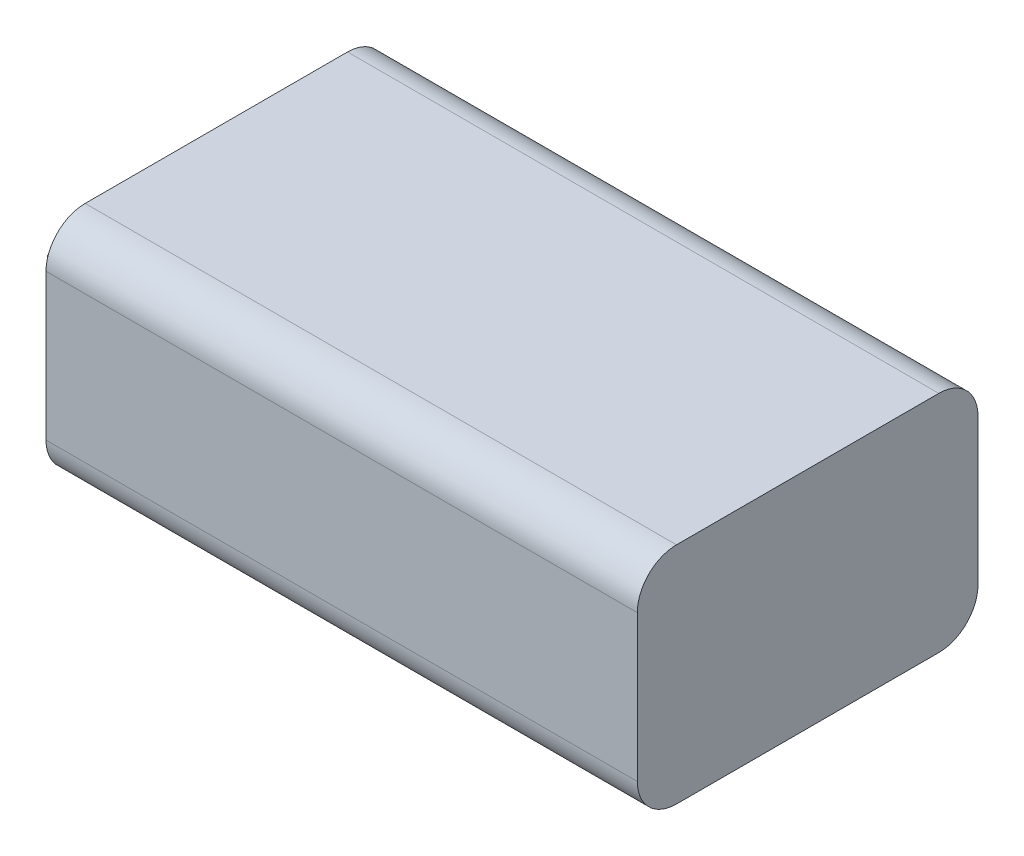
ISO-10303-21;
HEADER;
FILE_DESCRIPTION(('STEP AP214'),'2;1');
FILE_NAME('part.step','',(''),(''),'','','');
FILE_SCHEMA(('AUTOMOTIVE_DESIGN { 1 0 10303 214 1 1 1 1 }'));
ENDSEC;
DATA;
#1=APPLICATION_CONTEXT('core data for automotive mechanical design processes');
#2=APPLICATION_PROTOCOL_DEFINITION('international standard','automotive_design',2000,#1);
#3=PRODUCT_CONTEXT('',#1,'mechanical');
#4=PRODUCT('Part','Part','',(#3));
#5=PRODUCT_RELATED_PRODUCT_CATEGORY('part','',(#4));
#6=PRODUCT_DEFINITION_FORMATION('','',#4);
#7=PRODUCT_DEFINITION_CONTEXT('part definition',#1,'design');
#8=PRODUCT_DEFINITION('design','',#6,#7);
#9=PRODUCT_DEFINITION_SHAPE('','',#8);
#10=(LENGTH_UNIT() NAMED_UNIT(*) SI_UNIT(.MILLI.,.METRE.));
#11=(NAMED_UNIT(*) PLANE_ANGLE_UNIT() SI_UNIT($,.RADIAN.));
#12=(NAMED_UNIT(*) SI_UNIT($,.STERADIAN.) SOLID_ANGLE_UNIT());
#13=UNCERTAINTY_MEASURE_WITH_UNIT(LENGTH_MEASURE(1.E-05),#10,'distance_accuracy_value','');
#14=(GEOMETRIC_REPRESENTATION_CONTEXT(3) GLOBAL_UNCERTAINTY_ASSIGNED_CONTEXT((#13)) GLOBAL_UNIT_ASSIGNED_CONTEXT((#10,
#11,#12)) REPRESENTATION_CONTEXT('',''));
#15=CARTESIAN_POINT('',(0.,0.,0.));
#16=DIRECTION('',(0.,0.,1.));
#17=DIRECTION('',(1.,0.,0.));
#18=AXIS2_PLACEMENT_3D('',#15,#16,#17);
#19=CARTESIAN_POINT('',(-32.2060701312199,17.2,0.));
#20=DIRECTION('',(-1.,0.,0.));
#21=DIRECTION('',(0.,0.,1.));
#22=AXIS2_PLACEMENT_3D('',#19,#20,#21);
#23=PLANE('',#22);
#24=DIRECTION('',(0.,0.,-1.));
#25=VECTOR('',#24,1.);
#26=CARTESIAN_POINT('',(-32.2060701312199,17.2,0.));
#27=LINE('',#26,#25);
#28=CARTESIAN_POINT('',(-32.2060701312199,17.2,6.82588235294117));
#29=VERTEX_POINT('',#28);
#30=CARTESIAN_POINT('',(-32.2060701312199,17.2,-13.2741176470588));
#31=VERTEX_POINT('',#30);
#32=EDGE_CURVE('E192',#29,#31,#27,.T.);
#33=ORIENTED_EDGE('',*,*,#32,.T.);
#34=CARTESIAN_POINT('',(-32.2060701312199,14.2,-13.2741176470588));
#35=DIRECTION('',(-1.,0.,0.));
#36=DIRECTION('',(0.,0.,1.));
#37=AXIS2_PLACEMENT_3D('',#34,#35,#36);
#38=CIRCLE('',#37,3.);
#39=CARTESIAN_POINT('',(-32.2060701312199,14.2,-16.2741176470588));
#40=VERTEX_POINT('',#39);
#41=EDGE_CURVE('E252',#31,#40,#38,.T.);
#42=ORIENTED_EDGE('',*,*,#41,.T.);
#43=DIRECTION('',(0.,-1.,0.));
#44=VECTOR('',#43,1.);
#45=CARTESIAN_POINT('',(-32.2060701312199,17.2,-16.2741176470588));
#46=LINE('',#45,#44);
#47=CARTESIAN_POINT('',(-32.2060701312199,3.,-16.2741176470588));
#48=VERTEX_POINT('',#47);
#49=EDGE_CURVE('E206',#40,#48,#46,.T.);
#50=ORIENTED_EDGE('',*,*,#49,.T.);
#51=CARTESIAN_POINT('',(-32.2060701312199,3.,-13.2741176470588));
#52=DIRECTION('',(-1.,0.,0.));
#53=DIRECTION('',(0.,0.,1.));
#54=AXIS2_PLACEMENT_3D('',#51,#52,#53);
#55=CIRCLE('',#54,3.);
#56=CARTESIAN_POINT('',(-32.2060701312199,0.,-13.2741176470588));
#57=VERTEX_POINT('',#56);
#58=EDGE_CURVE('E249',#48,#57,#55,.T.);
#59=ORIENTED_EDGE('',*,*,#58,.T.);
#60=DIRECTION('',(0.,0.,-1.));
#61=VECTOR('',#60,1.);
#62=CARTESIAN_POINT('',(-32.2060701312199,0.,0.));
#63=LINE('',#62,#61);
#64=CARTESIAN_POINT('',(-32.2060701312199,0.,6.82588235294117));
#65=VERTEX_POINT('',#64);
#66=EDGE_CURVE('E193',#65,#57,#63,.T.);
#67=ORIENTED_EDGE('',*,*,#66,.F.);
#68=CARTESIAN_POINT('',(-32.2060701312199,3.,6.82588235294117));
#69=DIRECTION('',(-1.,0.,0.));
#70=DIRECTION('',(0.,0.,1.));
#71=AXIS2_PLACEMENT_3D('',#68,#69,#70);
#72=CIRCLE('',#71,3.);
#73=CARTESIAN_POINT('',(-32.2060701312199,3.,9.82588235294117));
#74=VERTEX_POINT('',#73);
#75=EDGE_CURVE('E69',#65,#74,#72,.T.);
#76=ORIENTED_EDGE('',*,*,#75,.T.);
#77=DIRECTION('',(0.,-1.,0.));
#78=VECTOR('',#77,1.);
#79=CARTESIAN_POINT('',(-32.2060701312199,17.2,9.82588235294117));
#80=LINE('',#79,#78);
#81=CARTESIAN_POINT('',(-32.2060701312199,14.2,9.82588235294117));
#82=VERTEX_POINT('',#81);
#83=EDGE_CURVE('E197',#82,#74,#80,.T.);
#84=ORIENTED_EDGE('',*,*,#83,.F.);
#85=CARTESIAN_POINT('',(-32.2060701312199,14.2,6.82588235294117));
#86=DIRECTION('',(-1.,0.,0.));
#87=DIRECTION('',(0.,0.,1.));
#88=AXIS2_PLACEMENT_3D('',#85,#86,#87);
#89=CIRCLE('',#88,3.);
#90=EDGE_CURVE('E244',#82,#29,#89,.T.);
#91=ORIENTED_EDGE('',*,*,#90,.T.);
#92=EDGE_LOOP('',(#33,#42,#50,#59,#67,#76,#84,#91));
#93=FACE_BOUND('',#92,.T.);
#94=DIRECTION('',(0.,-1.,0.));
#95=VECTOR('',#94,1.);
#96=CARTESIAN_POINT('',(-32.2060701312199,12.5,7.02588235294117));
#97=LINE('',#96,#95);
#98=CARTESIAN_POINT('',(-32.2060701312199,12.5,7.02588235294117));
#99=VERTEX_POINT('',#98);
#100=CARTESIAN_POINT('',(-32.2060701312199,4.,7.02588235294117));
#101=VERTEX_POINT('',#100);
#102=EDGE_CURVE('E146',#99,#101,#97,.T.);
#103=ORIENTED_EDGE('',*,*,#102,.T.);
#104=DIRECTION('',(0.,0.,-1.));
#105=VECTOR('',#104,1.);
#106=CARTESIAN_POINT('',(-32.2060701312199,4.,0.));
#107=LINE('',#106,#105);
#108=CARTESIAN_POINT('',(-32.2060701312199,4.,-12.4741176470588));
#109=VERTEX_POINT('',#108);
#110=EDGE_CURVE('E174',#101,#109,#107,.T.);
#111=ORIENTED_EDGE('',*,*,#110,.T.);
#112=DIRECTION('',(0.,-1.,0.));
#113=VECTOR('',#112,1.);
#114=CARTESIAN_POINT('',(-32.2060701312199,12.5,-12.4741176470588));
#115=LINE('',#114,#113);
#116=CARTESIAN_POINT('',(-32.2060701312199,12.5,-12.4741176470588));
#117=VERTEX_POINT('',#116);
#118=EDGE_CURVE('E183',#117,#109,#115,.T.);
#119=ORIENTED_EDGE('',*,*,#118,.F.);
#120=DIRECTION('',(0.,0.,-1.));
#121=VECTOR('',#120,1.);
#122=CARTESIAN_POINT('',(-32.2060701312199,12.5,0.));
#123=LINE('',#122,#121);
#124=EDGE_CURVE('E162',#99,#117,#123,.T.);
#125=ORIENTED_EDGE('',*,*,#124,.F.);
#126=EDGE_LOOP('',(#103,#111,#119,#125));
#127=FACE_BOUND('',#126,.T.);
#128=ADVANCED_FACE('F45',(#93,#127),#23,.T.);
#129=CARTESIAN_POINT('',(0.,17.2,9.82588235294117));
#130=DIRECTION('',(0.,0.,-1.));
#131=DIRECTION('',(-1.,0.,0.));
#132=AXIS2_PLACEMENT_3D('',#129,#130,#131);
#133=PLANE('',#132);
#134=ORIENTED_EDGE('',*,*,#83,.T.);
#135=DIRECTION('',(1.,0.,0.));
#136=VECTOR('',#135,1.);
#137=CARTESIAN_POINT('',(0.,3.,9.82588235294117));
#138=LINE('',#137,#136);
#139=CARTESIAN_POINT('',(13.0939298687801,3.,9.82588235294117));
#140=VERTEX_POINT('',#139);
#141=EDGE_CURVE('E11',#74,#140,#138,.T.);
#142=ORIENTED_EDGE('',*,*,#141,.T.);
#143=DIRECTION('',(0.,-1.,0.));
#144=VECTOR('',#143,1.);
#145=CARTESIAN_POINT('',(13.0939298687801,17.2,9.82588235294117));
#146=LINE('',#145,#144);
#147=CARTESIAN_POINT('',(13.0939298687801,14.2,9.82588235294117));
#148=VERTEX_POINT('',#147);
#149=EDGE_CURVE('E214',#148,#140,#146,.T.);
#150=ORIENTED_EDGE('',*,*,#149,.F.);
#151=DIRECTION('',(1.,0.,0.));
#152=VECTOR('',#151,1.);
#153=CARTESIAN_POINT('',(-32.2060701312199,14.2,9.82588235294117));
#154=LINE('',#153,#152);
#155=EDGE_CURVE('E54',#148,#82,#154,.F.);
#156=ORIENTED_EDGE('',*,*,#155,.T.);
#157=EDGE_LOOP('',(#134,#142,#150,#156));
#158=FACE_BOUND('',#157,.T.);
#159=ADVANCED_FACE('F265',(#158),#133,.F.);
#160=CARTESIAN_POINT('',(13.0939298687801,17.2,0.));
#161=DIRECTION('',(-1.,0.,0.));
#162=DIRECTION('',(0.,0.,1.));
#163=AXIS2_PLACEMENT_3D('',#160,#161,#162);
#164=PLANE('',#163);
#165=DIRECTION('',(0.,-1.,0.));
#166=VECTOR('',#165,1.);
#167=CARTESIAN_POINT('',(13.0939298687801,17.2,-16.2741176470588));
#168=LINE('',#167,#166);
#169=CARTESIAN_POINT('',(13.0939298687801,14.2,-16.2741176470588));
#170=VERTEX_POINT('',#169);
#171=CARTESIAN_POINT('',(13.0939298687801,3.,-16.2741176470588));
#172=VERTEX_POINT('',#171);
#173=EDGE_CURVE('E210',#170,#172,#168,.T.);
#174=ORIENTED_EDGE('',*,*,#173,.F.);
#175=CARTESIAN_POINT('',(13.0939298687801,14.2,-13.2741176470588));
#176=DIRECTION('',(-1.,0.,0.));
#177=DIRECTION('',(0.,0.,1.));
#178=AXIS2_PLACEMENT_3D('',#175,#176,#177);
#179=CIRCLE('',#178,3.);
#180=CARTESIAN_POINT('',(13.0939298687801,17.2,-13.2741176470588));
#181=VERTEX_POINT('',#180);
#182=EDGE_CURVE('E234',#170,#181,#179,.F.);
#183=ORIENTED_EDGE('',*,*,#182,.T.);
#184=DIRECTION('',(0.,0.,-1.));
#185=VECTOR('',#184,1.);
#186=CARTESIAN_POINT('',(13.0939298687801,17.2,0.));
#187=LINE('',#186,#185);
#188=CARTESIAN_POINT('',(13.0939298687801,17.2,6.82588235294117));
#189=VERTEX_POINT('',#188);
#190=EDGE_CURVE('E188',#189,#181,#187,.T.);
#191=ORIENTED_EDGE('',*,*,#190,.F.);
#192=CARTESIAN_POINT('',(13.0939298687801,14.2,6.82588235294117));
#193=DIRECTION('',(-1.,0.,0.));
#194=DIRECTION('',(0.,0.,1.));
#195=AXIS2_PLACEMENT_3D('',#192,#193,#194);
#196=CIRCLE('',#195,3.);
#197=EDGE_CURVE('E225',#189,#148,#196,.F.);
#198=ORIENTED_EDGE('',*,*,#197,.T.);
#199=ORIENTED_EDGE('',*,*,#149,.T.);
#200=CARTESIAN_POINT('',(13.0939298687801,3.,6.82588235294117));
#201=DIRECTION('',(-1.,0.,0.));
#202=DIRECTION('',(0.,0.,1.));
#203=AXIS2_PLACEMENT_3D('',#200,#201,#202);
#204=CIRCLE('',#203,3.);
#205=CARTESIAN_POINT('',(13.0939298687801,0.,6.82588235294117));
#206=VERTEX_POINT('',#205);
#207=EDGE_CURVE('E228',#140,#206,#204,.F.);
#208=ORIENTED_EDGE('',*,*,#207,.T.);
#209=DIRECTION('',(0.,0.,-1.));
#210=VECTOR('',#209,1.);
#211=CARTESIAN_POINT('',(13.0939298687801,0.,0.));
#212=LINE('',#211,#210);
#213=CARTESIAN_POINT('',(13.0939298687801,0.,-13.2741176470588));
#214=VERTEX_POINT('',#213);
#215=EDGE_CURVE('E145',#206,#214,#212,.T.);
#216=ORIENTED_EDGE('',*,*,#215,.T.);
#217=CARTESIAN_POINT('',(13.0939298687801,3.,-13.2741176470588));
#218=DIRECTION('',(-1.,0.,0.));
#219=DIRECTION('',(0.,0.,1.));
#220=AXIS2_PLACEMENT_3D('',#217,#218,#219);
#221=CIRCLE('',#220,3.);
#222=EDGE_CURVE('E231',#214,#172,#221,.F.);
#223=ORIENTED_EDGE('',*,*,#222,.T.);
#224=EDGE_LOOP('',(#174,#183,#191,#198,#199,#208,#216,#223));
#225=FACE_BOUND('',#224,.T.);
#226=ADVANCED_FACE('F278',(#225),#164,.F.);
#227=CARTESIAN_POINT('',(0.,17.2,-16.2741176470588));
#228=DIRECTION('',(0.,0.,-1.));
#229=DIRECTION('',(-1.,0.,0.));
#230=AXIS2_PLACEMENT_3D('',#227,#228,#229);
#231=PLANE('',#230);
#232=ORIENTED_EDGE('',*,*,#49,.F.);
#233=DIRECTION('',(1.,0.,0.));
#234=VECTOR('',#233,1.);
#235=CARTESIAN_POINT('',(0.,14.2,-16.2741176470588));
#236=LINE('',#235,#234);
#237=EDGE_CURVE('E221',#40,#170,#236,.T.);
#238=ORIENTED_EDGE('',*,*,#237,.T.);
#239=ORIENTED_EDGE('',*,*,#173,.T.);
#240=DIRECTION('',(1.,0.,0.));
#241=VECTOR('',#240,1.);
#242=CARTESIAN_POINT('',(-32.2060701312199,3.,-16.2741176470588));
#243=LINE('',#242,#241);
#244=EDGE_CURVE('E218',#172,#48,#243,.F.);
#245=ORIENTED_EDGE('',*,*,#244,.T.);
#246=EDGE_LOOP('',(#232,#238,#239,#245));
#247=FACE_BOUND('',#246,.T.);
#248=ADVANCED_FACE('F285',(#247),#231,.T.);
#249=CARTESIAN_POINT('',(0.,17.2,0.));
#250=DIRECTION('',(0.,1.,0.));
#251=DIRECTION('',(0.,0.,1.));
#252=AXIS2_PLACEMENT_3D('',#249,#250,#251);
#253=PLANE('',#252);
#254=ORIENTED_EDGE('',*,*,#190,.T.);
#255=DIRECTION('',(1.,0.,0.));
#256=VECTOR('',#255,1.);
#257=CARTESIAN_POINT('',(0.,17.2,-13.2741176470588));
#258=LINE('',#257,#256);
#259=EDGE_CURVE('E241',#181,#31,#258,.F.);
#260=ORIENTED_EDGE('',*,*,#259,.T.);
#261=ORIENTED_EDGE('',*,*,#32,.F.);
#262=DIRECTION('',(1.,0.,0.));
#263=VECTOR('',#262,1.);
#264=CARTESIAN_POINT('',(13.0939298687801,17.2,6.82588235294117));
#265=LINE('',#264,#263);
#266=EDGE_CURVE('E237',#29,#189,#265,.T.);
#267=ORIENTED_EDGE('',*,*,#266,.T.);
#268=EDGE_LOOP('',(#254,#260,#261,#267));
#269=FACE_BOUND('',#268,.T.);
#270=ADVANCED_FACE('F274',(#269),#253,.T.);
#271=CARTESIAN_POINT('',(0.,0.,0.));
#272=DIRECTION('',(0.,1.,0.));
#273=DIRECTION('',(0.,0.,1.));
#274=AXIS2_PLACEMENT_3D('',#271,#272,#273);
#275=PLANE('',#274);
#276=ORIENTED_EDGE('',*,*,#66,.T.);
#277=DIRECTION('',(1.,0.,0.));
#278=VECTOR('',#277,1.);
#279=CARTESIAN_POINT('',(13.0939298687801,0.,-13.2741176470588));
#280=LINE('',#279,#278);
#281=EDGE_CURVE('E258',#57,#214,#280,.T.);
#282=ORIENTED_EDGE('',*,*,#281,.T.);
#283=ORIENTED_EDGE('',*,*,#215,.F.);
#284=DIRECTION('',(1.,0.,0.));
#285=VECTOR('',#284,1.);
#286=CARTESIAN_POINT('',(0.,0.,6.82588235294117));
#287=LINE('',#286,#285);
#288=EDGE_CURVE('E255',#206,#65,#287,.F.);
#289=ORIENTED_EDGE('',*,*,#288,.T.);
#290=EDGE_LOOP('',(#276,#282,#283,#289));
#291=FACE_BOUND('',#290,.T.);
#292=ADVANCED_FACE('F293',(#291),#275,.F.);
#293=CARTESIAN_POINT('',(0.,14.2,-13.2741176470588));
#294=DIRECTION('',(1.,0.,0.));
#295=DIRECTION('',(0.,0.,-1.));
#296=AXIS2_PLACEMENT_3D('',#293,#294,#295);
#297=CYLINDRICAL_SURFACE('',#296,3.);
#298=ORIENTED_EDGE('',*,*,#41,.F.);
#299=ORIENTED_EDGE('',*,*,#259,.F.);
#300=ORIENTED_EDGE('',*,*,#182,.F.);
#301=ORIENTED_EDGE('',*,*,#237,.F.);
#302=EDGE_LOOP('',(#298,#299,#300,#301));
#303=FACE_BOUND('',#302,.T.);
#304=ADVANCED_FACE('F282',(#303),#297,.T.);
#305=CARTESIAN_POINT('',(0.,3.,-13.2741176470588));
#306=DIRECTION('',(-1.,0.,0.));
#307=DIRECTION('',(0.,0.,1.));
#308=AXIS2_PLACEMENT_3D('',#305,#306,#307);
#309=CYLINDRICAL_SURFACE('',#308,3.);
#310=ORIENTED_EDGE('',*,*,#58,.F.);
#311=ORIENTED_EDGE('',*,*,#244,.F.);
#312=ORIENTED_EDGE('',*,*,#222,.F.);
#313=ORIENTED_EDGE('',*,*,#281,.F.);
#314=EDGE_LOOP('',(#310,#311,#312,#313));
#315=FACE_BOUND('',#314,.T.);
#316=ADVANCED_FACE('F290',(#315),#309,.T.);
#317=CARTESIAN_POINT('',(0.,3.,6.82588235294117));
#318=DIRECTION('',(1.,0.,0.));
#319=DIRECTION('',(0.,0.,-1.));
#320=AXIS2_PLACEMENT_3D('',#317,#318,#319);
#321=CYLINDRICAL_SURFACE('',#320,3.);
#322=ORIENTED_EDGE('',*,*,#75,.F.);
#323=ORIENTED_EDGE('',*,*,#288,.F.);
#324=ORIENTED_EDGE('',*,*,#207,.F.);
#325=ORIENTED_EDGE('',*,*,#141,.F.);
#326=EDGE_LOOP('',(#322,#323,#324,#325));
#327=FACE_BOUND('',#326,.T.);
#328=ADVANCED_FACE('F296',(#327),#321,.T.);
#329=CARTESIAN_POINT('',(0.,14.2,6.82588235294117));
#330=DIRECTION('',(-1.,0.,0.));
#331=DIRECTION('',(0.,0.,1.));
#332=AXIS2_PLACEMENT_3D('',#329,#330,#331);
#333=CYLINDRICAL_SURFACE('',#332,3.);
#334=ORIENTED_EDGE('',*,*,#90,.F.);
#335=ORIENTED_EDGE('',*,*,#155,.F.);
#336=ORIENTED_EDGE('',*,*,#197,.F.);
#337=ORIENTED_EDGE('',*,*,#266,.F.);
#338=EDGE_LOOP('',(#334,#335,#336,#337));
#339=FACE_BOUND('',#338,.T.);
#340=ADVANCED_FACE('F47',(#339),#333,.T.);
#341=CARTESIAN_POINT('',(-34.9060701312199,12.5,0.));
#342=DIRECTION('',(-1.,0.,0.));
#343=DIRECTION('',(0.,0.,1.));
#344=AXIS2_PLACEMENT_3D('',#341,#342,#343);
#345=PLANE('',#344);
#346=DIRECTION('',(0.,0.,-1.));
#347=VECTOR('',#346,1.);
#348=CARTESIAN_POINT('',(-34.9060701312199,4.,0.));
#349=LINE('',#348,#347);
#350=CARTESIAN_POINT('',(-34.9060701312199,4.,7.02588235294117));
#351=VERTEX_POINT('',#350);
#352=CARTESIAN_POINT('',(-34.9060701312199,4.,-12.4741176470588));
#353=VERTEX_POINT('',#352);
#354=EDGE_CURVE('E142',#351,#353,#349,.T.);
#355=ORIENTED_EDGE('',*,*,#354,.F.);
#356=DIRECTION('',(0.,-1.,0.));
#357=VECTOR('',#356,1.);
#358=CARTESIAN_POINT('',(-34.9060701312199,12.5,7.02588235294117));
#359=LINE('',#358,#357);
#360=CARTESIAN_POINT('',(-34.9060701312199,12.5,7.02588235294117));
#361=VERTEX_POINT('',#360);
#362=EDGE_CURVE('E137',#361,#351,#359,.T.);
#363=ORIENTED_EDGE('',*,*,#362,.F.);
#364=DIRECTION('',(0.,0.,-1.));
#365=VECTOR('',#364,1.);
#366=CARTESIAN_POINT('',(-34.9060701312199,12.5,0.));
#367=LINE('',#366,#365);
#368=CARTESIAN_POINT('',(-34.9060701312199,12.5,-12.4741176470588));
#369=VERTEX_POINT('',#368);
#370=EDGE_CURVE('E140',#361,#369,#367,.T.);
#371=ORIENTED_EDGE('',*,*,#370,.T.);
#372=DIRECTION('',(0.,-1.,0.));
#373=VECTOR('',#372,1.);
#374=CARTESIAN_POINT('',(-34.9060701312199,12.5,-12.4741176470588));
#375=LINE('',#374,#373);
#376=EDGE_CURVE('E169',#369,#353,#375,.T.);
#377=ORIENTED_EDGE('',*,*,#376,.T.);
#378=EDGE_LOOP('',(#355,#363,#371,#377));
#379=FACE_BOUND('',#378,.T.);
#380=ADVANCED_FACE('F139',(#379),#345,.T.);
#381=CARTESIAN_POINT('',(0.,12.5,7.02588235294117));
#382=DIRECTION('',(0.,0.,1.));
#383=DIRECTION('',(1.,0.,0.));
#384=AXIS2_PLACEMENT_3D('',#381,#382,#383);
#385=PLANE('',#384);
#386=DIRECTION('',(-1.,0.,0.));
#387=VECTOR('',#386,1.);
#388=CARTESIAN_POINT('',(0.,4.,7.02588235294117));
#389=LINE('',#388,#387);
#390=EDGE_CURVE('E61',#101,#351,#389,.T.);
#391=ORIENTED_EDGE('',*,*,#390,.F.);
#392=ORIENTED_EDGE('',*,*,#102,.F.);
#393=DIRECTION('',(-1.,0.,0.));
#394=VECTOR('',#393,1.);
#395=CARTESIAN_POINT('',(0.,12.5,7.02588235294117));
#396=LINE('',#395,#394);
#397=EDGE_CURVE('E151',#99,#361,#396,.T.);
#398=ORIENTED_EDGE('',*,*,#397,.T.);
#399=ORIENTED_EDGE('',*,*,#362,.T.);
#400=EDGE_LOOP('',(#391,#392,#398,#399));
#401=FACE_BOUND('',#400,.T.);
#402=ADVANCED_FACE('F159',(#401),#385,.T.);
#403=CARTESIAN_POINT('',(0.,12.5,-12.4741176470588));
#404=DIRECTION('',(0.,0.,1.));
#405=DIRECTION('',(1.,0.,0.));
#406=AXIS2_PLACEMENT_3D('',#403,#404,#405);
#407=PLANE('',#406);
#408=DIRECTION('',(-1.,0.,0.));
#409=VECTOR('',#408,1.);
#410=CARTESIAN_POINT('',(0.,4.,-12.4741176470588));
#411=LINE('',#410,#409);
#412=EDGE_CURVE('E157',#109,#353,#411,.T.);
#413=ORIENTED_EDGE('',*,*,#412,.T.);
#414=ORIENTED_EDGE('',*,*,#376,.F.);
#415=DIRECTION('',(-1.,0.,0.));
#416=VECTOR('',#415,1.);
#417=CARTESIAN_POINT('',(0.,12.5,-12.4741176470588));
#418=LINE('',#417,#416);
#419=EDGE_CURVE('E154',#117,#369,#418,.T.);
#420=ORIENTED_EDGE('',*,*,#419,.F.);
#421=ORIENTED_EDGE('',*,*,#118,.T.);
#422=EDGE_LOOP('',(#413,#414,#420,#421));
#423=FACE_BOUND('',#422,.T.);
#424=ADVANCED_FACE('F330',(#423),#407,.F.);
#425=CARTESIAN_POINT('',(0.,12.5,0.));
#426=DIRECTION('',(0.,1.,0.));
#427=DIRECTION('',(0.,0.,1.));
#428=AXIS2_PLACEMENT_3D('',#425,#426,#427);
#429=PLANE('',#428);
#430=ORIENTED_EDGE('',*,*,#370,.F.);
#431=ORIENTED_EDGE('',*,*,#397,.F.);
#432=ORIENTED_EDGE('',*,*,#124,.T.);
#433=ORIENTED_EDGE('',*,*,#419,.T.);
#434=EDGE_LOOP('',(#430,#431,#432,#433));
#435=FACE_BOUND('',#434,.T.);
#436=ADVANCED_FACE('F150',(#435),#429,.T.);
#437=CARTESIAN_POINT('',(0.,4.,0.));
#438=DIRECTION('',(0.,1.,0.));
#439=DIRECTION('',(0.,0.,1.));
#440=AXIS2_PLACEMENT_3D('',#437,#438,#439);
#441=PLANE('',#440);
#442=ORIENTED_EDGE('',*,*,#354,.T.);
#443=ORIENTED_EDGE('',*,*,#412,.F.);
#444=ORIENTED_EDGE('',*,*,#110,.F.);
#445=ORIENTED_EDGE('',*,*,#390,.T.);
#446=EDGE_LOOP('',(#442,#443,#444,#445));
#447=FACE_BOUND('',#446,.T.);
#448=ADVANCED_FACE('F334',(#447),#441,.F.);
#449=CLOSED_SHELL('',(#128,#159,#226,#248,#270,#292,#304,#316,#328,#340,#380,#402,#424,#436,#448));
#450=MANIFOLD_SOLID_BREP('B2',#449);
#451=ADVANCED_BREP_SHAPE_REPRESENTATION('',(#18,#450),#14);
#452=SHAPE_DEFINITION_REPRESENTATION(#9,#451);
ENDSEC;
END-ISO-10303-21;
